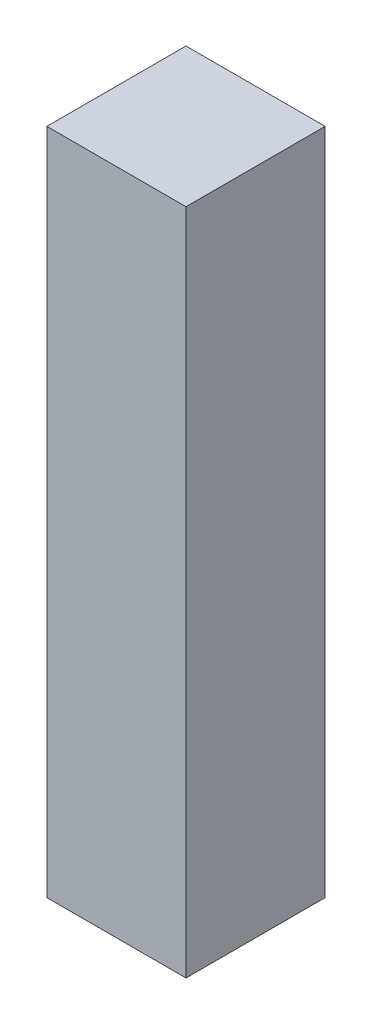
ISO-10303-21;
HEADER;
FILE_DESCRIPTION(('STEP AP214'),'2;1');
FILE_NAME('part.step','',(''),(''),'','','');
FILE_SCHEMA(('AUTOMOTIVE_DESIGN { 1 0 10303 214 1 1 1 1 }'));
ENDSEC;
DATA;
#1=APPLICATION_CONTEXT('core data for automotive mechanical design processes');
#2=APPLICATION_PROTOCOL_DEFINITION('international standard','automotive_design',2000,#1);
#3=PRODUCT_CONTEXT('',#1,'mechanical');
#4=PRODUCT('Part','Part','',(#3));
#5=PRODUCT_RELATED_PRODUCT_CATEGORY('part','',(#4));
#6=PRODUCT_DEFINITION_FORMATION('','',#4);
#7=PRODUCT_DEFINITION_CONTEXT('part definition',#1,'design');
#8=PRODUCT_DEFINITION('design','',#6,#7);
#9=PRODUCT_DEFINITION_SHAPE('','',#8);
#10=(LENGTH_UNIT() NAMED_UNIT(*) SI_UNIT(.MILLI.,.METRE.));
#11=(NAMED_UNIT(*) PLANE_ANGLE_UNIT() SI_UNIT($,.RADIAN.));
#12=(NAMED_UNIT(*) SI_UNIT($,.STERADIAN.) SOLID_ANGLE_UNIT());
#13=UNCERTAINTY_MEASURE_WITH_UNIT(LENGTH_MEASURE(1.E-05),#10,'distance_accuracy_value','');
#14=(GEOMETRIC_REPRESENTATION_CONTEXT(3) GLOBAL_UNCERTAINTY_ASSIGNED_CONTEXT((#13)) GLOBAL_UNIT_ASSIGNED_CONTEXT((#10,
#11,#12)) REPRESENTATION_CONTEXT('',''));
#15=CARTESIAN_POINT('',(0.,0.,0.));
#16=DIRECTION('',(0.,0.,1.));
#17=DIRECTION('',(1.,0.,0.));
#18=AXIS2_PLACEMENT_3D('',#15,#16,#17);
#19=CARTESIAN_POINT('',(-100.,480.,100.));
#20=DIRECTION('',(0.,1.,0.));
#21=DIRECTION('',(0.,0.,1.));
#22=AXIS2_PLACEMENT_3D('',#19,#20,#21);
#23=PLANE('',#22);
#24=DIRECTION('',(1.,0.,0.));
#25=VECTOR('',#24,1.);
#26=CARTESIAN_POINT('',(-100.,480.,0.));
#27=LINE('',#26,#25);
#28=CARTESIAN_POINT('',(-100.,480.,0.));
#29=VERTEX_POINT('',#28);
#30=CARTESIAN_POINT('',(0.,480.,0.));
#31=VERTEX_POINT('',#30);
#32=EDGE_CURVE('E115',#29,#31,#27,.T.);
#33=ORIENTED_EDGE('',*,*,#32,.F.);
#34=DIRECTION('',(0.,0.,-1.));
#35=VECTOR('',#34,1.);
#36=CARTESIAN_POINT('',(-100.,480.,100.));
#37=LINE('',#36,#35);
#38=CARTESIAN_POINT('',(-100.,480.,100.));
#39=VERTEX_POINT('',#38);
#40=EDGE_CURVE('E11',#39,#29,#37,.T.);
#41=ORIENTED_EDGE('',*,*,#40,.F.);
#42=DIRECTION('',(1.,0.,0.));
#43=VECTOR('',#42,1.);
#44=CARTESIAN_POINT('',(-100.,480.,100.));
#45=LINE('',#44,#43);
#46=CARTESIAN_POINT('',(0.,480.,100.));
#47=VERTEX_POINT('',#46);
#48=EDGE_CURVE('E107',#39,#47,#45,.T.);
#49=ORIENTED_EDGE('',*,*,#48,.T.);
#50=DIRECTION('',(0.,0.,-1.));
#51=VECTOR('',#50,1.);
#52=CARTESIAN_POINT('',(0.,480.,100.));
#53=LINE('',#52,#51);
#54=EDGE_CURVE('E48',#47,#31,#53,.T.);
#55=ORIENTED_EDGE('',*,*,#54,.T.);
#56=EDGE_LOOP('',(#33,#41,#49,#55));
#57=FACE_BOUND('',#56,.T.);
#58=ADVANCED_FACE('F45',(#57),#23,.T.);
#59=CARTESIAN_POINT('',(-100.,0.,100.));
#60=DIRECTION('',(-1.,0.,0.));
#61=DIRECTION('',(0.,0.,1.));
#62=AXIS2_PLACEMENT_3D('',#59,#60,#61);
#63=PLANE('',#62);
#64=DIRECTION('',(0.,1.,0.));
#65=VECTOR('',#64,1.);
#66=CARTESIAN_POINT('',(-100.,0.,0.));
#67=LINE('',#66,#65);
#68=CARTESIAN_POINT('',(-100.,0.,0.));
#69=VERTEX_POINT('',#68);
#70=EDGE_CURVE('E110',#69,#29,#67,.T.);
#71=ORIENTED_EDGE('',*,*,#70,.F.);
#72=DIRECTION('',(0.,0.,-1.));
#73=VECTOR('',#72,1.);
#74=CARTESIAN_POINT('',(-100.,0.,100.));
#75=LINE('',#74,#73);
#76=CARTESIAN_POINT('',(-100.,0.,100.));
#77=VERTEX_POINT('',#76);
#78=EDGE_CURVE('E55',#77,#69,#75,.T.);
#79=ORIENTED_EDGE('',*,*,#78,.F.);
#80=DIRECTION('',(0.,1.,0.));
#81=VECTOR('',#80,1.);
#82=CARTESIAN_POINT('',(-100.,0.,100.));
#83=LINE('',#82,#81);
#84=EDGE_CURVE('E102',#77,#39,#83,.T.);
#85=ORIENTED_EDGE('',*,*,#84,.T.);
#86=ORIENTED_EDGE('',*,*,#40,.T.);
#87=EDGE_LOOP('',(#71,#79,#85,#86));
#88=FACE_BOUND('',#87,.T.);
#89=ADVANCED_FACE('F131',(#88),#63,.T.);
#90=CARTESIAN_POINT('',(0.,0.,100.));
#91=DIRECTION('',(0.,-1.,0.));
#92=DIRECTION('',(1.,0.,0.));
#93=AXIS2_PLACEMENT_3D('',#90,#91,#92);
#94=PLANE('',#93);
#95=DIRECTION('',(-1.,0.,0.));
#96=VECTOR('',#95,1.);
#97=CARTESIAN_POINT('',(0.,0.,0.));
#98=LINE('',#97,#96);
#99=CARTESIAN_POINT('',(0.,0.,0.));
#100=VERTEX_POINT('',#99);
#101=EDGE_CURVE('E96',#100,#69,#98,.T.);
#102=ORIENTED_EDGE('',*,*,#101,.F.);
#103=DIRECTION('',(0.,0.,-1.));
#104=VECTOR('',#103,1.);
#105=CARTESIAN_POINT('',(0.,0.,100.));
#106=LINE('',#105,#104);
#107=CARTESIAN_POINT('',(0.,0.,100.));
#108=VERTEX_POINT('',#107);
#109=EDGE_CURVE('E91',#108,#100,#106,.T.);
#110=ORIENTED_EDGE('',*,*,#109,.F.);
#111=DIRECTION('',(-1.,0.,0.));
#112=VECTOR('',#111,1.);
#113=CARTESIAN_POINT('',(0.,0.,100.));
#114=LINE('',#113,#112);
#115=EDGE_CURVE('E94',#108,#77,#114,.T.);
#116=ORIENTED_EDGE('',*,*,#115,.T.);
#117=ORIENTED_EDGE('',*,*,#78,.T.);
#118=EDGE_LOOP('',(#102,#110,#116,#117));
#119=FACE_BOUND('',#118,.T.);
#120=ADVANCED_FACE('F93',(#119),#94,.T.);
#121=CARTESIAN_POINT('',(0.,480.,100.));
#122=DIRECTION('',(1.,0.,0.));
#123=DIRECTION('',(0.,0.,-1.));
#124=AXIS2_PLACEMENT_3D('',#121,#122,#123);
#125=PLANE('',#124);
#126=DIRECTION('',(0.,-1.,0.));
#127=VECTOR('',#126,1.);
#128=CARTESIAN_POINT('',(0.,480.,0.));
#129=LINE('',#128,#127);
#130=EDGE_CURVE('E119',#31,#100,#129,.T.);
#131=ORIENTED_EDGE('',*,*,#130,.F.);
#132=ORIENTED_EDGE('',*,*,#54,.F.);
#133=DIRECTION('',(0.,-1.,0.));
#134=VECTOR('',#133,1.);
#135=CARTESIAN_POINT('',(0.,480.,100.));
#136=LINE('',#135,#134);
#137=EDGE_CURVE('E101',#47,#108,#136,.T.);
#138=ORIENTED_EDGE('',*,*,#137,.T.);
#139=ORIENTED_EDGE('',*,*,#109,.T.);
#140=EDGE_LOOP('',(#131,#132,#138,#139));
#141=FACE_BOUND('',#140,.T.);
#142=ADVANCED_FACE('F105',(#141),#125,.T.);
#143=CARTESIAN_POINT('',(0.,0.,100.));
#144=DIRECTION('',(0.,0.,-1.));
#145=DIRECTION('',(-1.,0.,0.));
#146=AXIS2_PLACEMENT_3D('',#143,#144,#145);
#147=PLANE('',#146);
#148=ORIENTED_EDGE('',*,*,#48,.F.);
#149=ORIENTED_EDGE('',*,*,#84,.F.);
#150=ORIENTED_EDGE('',*,*,#115,.F.);
#151=ORIENTED_EDGE('',*,*,#137,.F.);
#152=EDGE_LOOP('',(#148,#149,#150,#151));
#153=FACE_BOUND('',#152,.T.);
#154=ADVANCED_FACE('F100',(#153),#147,.F.);
#155=CARTESIAN_POINT('',(0.,0.,0.));
#156=DIRECTION('',(0.,0.,-1.));
#157=DIRECTION('',(-1.,0.,0.));
#158=AXIS2_PLACEMENT_3D('',#155,#156,#157);
#159=PLANE('',#158);
#160=ORIENTED_EDGE('',*,*,#32,.T.);
#161=ORIENTED_EDGE('',*,*,#130,.T.);
#162=ORIENTED_EDGE('',*,*,#101,.T.);
#163=ORIENTED_EDGE('',*,*,#70,.T.);
#164=EDGE_LOOP('',(#160,#161,#162,#163));
#165=FACE_BOUND('',#164,.T.);
#166=ADVANCED_FACE('F130',(#165),#159,.T.);
#167=CLOSED_SHELL('',(#58,#89,#120,#142,#154,#166));
#168=MANIFOLD_SOLID_BREP('B2',#167);
#169=ADVANCED_BREP_SHAPE_REPRESENTATION('',(#18,#168),#14);
#170=SHAPE_DEFINITION_REPRESENTATION(#9,#169);
ENDSEC;
END-ISO-10303-21;
